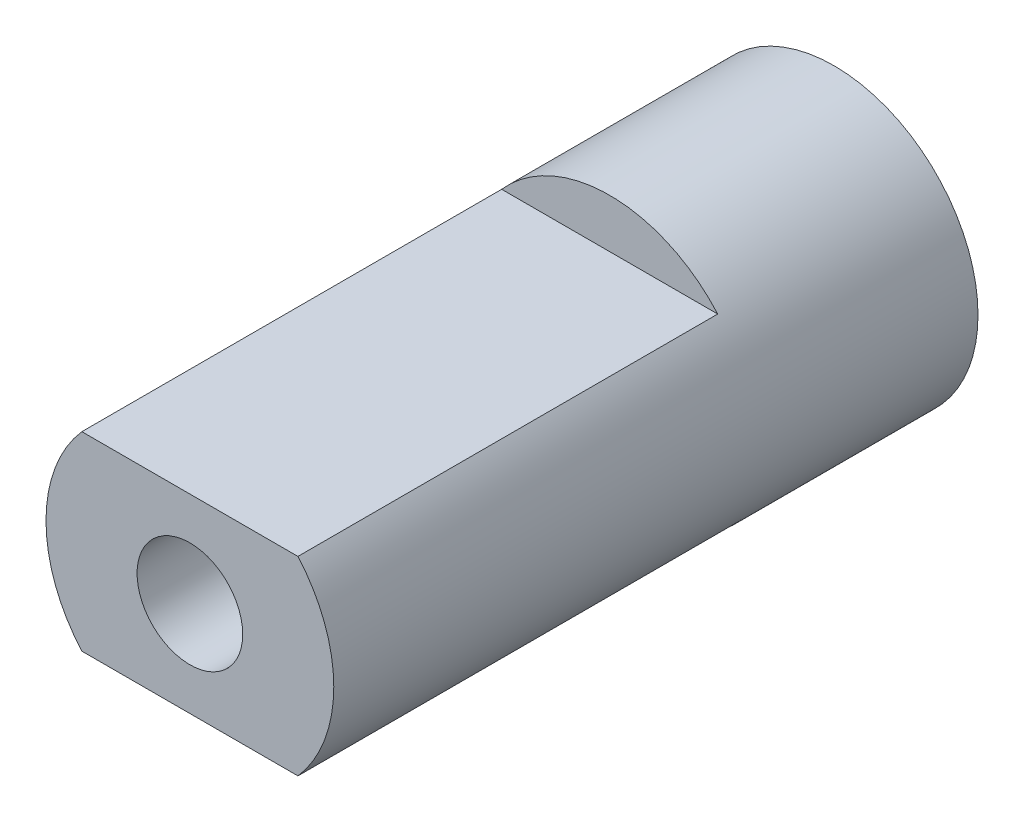
ISO-10303-21;
HEADER;
FILE_DESCRIPTION(('STEP AP214'),'2;1');
FILE_NAME('part.step','',(''),(''),'','','');
FILE_SCHEMA(('AUTOMOTIVE_DESIGN { 1 0 10303 214 1 1 1 1 }'));
ENDSEC;
DATA;
#1=APPLICATION_CONTEXT('core data for automotive mechanical design processes');
#2=APPLICATION_PROTOCOL_DEFINITION('international standard','automotive_design',2000,#1);
#3=PRODUCT_CONTEXT('',#1,'mechanical');
#4=PRODUCT('Part','Part','',(#3));
#5=PRODUCT_RELATED_PRODUCT_CATEGORY('part','',(#4));
#6=PRODUCT_DEFINITION_FORMATION('','',#4);
#7=PRODUCT_DEFINITION_CONTEXT('part definition',#1,'design');
#8=PRODUCT_DEFINITION('design','',#6,#7);
#9=PRODUCT_DEFINITION_SHAPE('','',#8);
#10=(LENGTH_UNIT() NAMED_UNIT(*) SI_UNIT(.MILLI.,.METRE.));
#11=(NAMED_UNIT(*) PLANE_ANGLE_UNIT() SI_UNIT($,.RADIAN.));
#12=(NAMED_UNIT(*) SI_UNIT($,.STERADIAN.) SOLID_ANGLE_UNIT());
#13=UNCERTAINTY_MEASURE_WITH_UNIT(LENGTH_MEASURE(1.E-05),#10,'distance_accuracy_value','');
#14=(GEOMETRIC_REPRESENTATION_CONTEXT(3) GLOBAL_UNCERTAINTY_ASSIGNED_CONTEXT((#13)) GLOBAL_UNIT_ASSIGNED_CONTEXT((#10,
#11,#12)) REPRESENTATION_CONTEXT('',''));
#15=CARTESIAN_POINT('',(0.,0.,0.));
#16=DIRECTION('',(0.,0.,1.));
#17=DIRECTION('',(1.,0.,0.));
#18=AXIS2_PLACEMENT_3D('',#15,#16,#17);
#19=CARTESIAN_POINT('',(0.,0.,3.));
#20=DIRECTION('',(0.,0.,-1.));
#21=DIRECTION('',(-1.,0.,0.));
#22=AXIS2_PLACEMENT_3D('',#19,#20,#21);
#23=CYLINDRICAL_SURFACE('',#22,1.);
#24=CARTESIAN_POINT('',(0.,0.,13.3));
#25=DIRECTION('',(0.,0.,1.));
#26=DIRECTION('',(1.,0.,0.));
#27=AXIS2_PLACEMENT_3D('',#24,#25,#26);
#28=CIRCLE('',#27,1.);
#29=CARTESIAN_POINT('',(1.,0.,13.3));
#30=VERTEX_POINT('',#29);
#31=EDGE_CURVE('E105',#30,#30,#28,.T.);
#32=ORIENTED_EDGE('',*,*,#31,.T.);
#33=EDGE_LOOP('',(#32));
#34=FACE_BOUND('',#33,.T.);
#35=CARTESIAN_POINT('',(0.,0.,1.1));
#36=DIRECTION('',(0.,0.,1.));
#37=DIRECTION('',(1.,0.,0.));
#38=AXIS2_PLACEMENT_3D('',#35,#36,#37);
#39=CIRCLE('',#38,1.);
#40=CARTESIAN_POINT('',(1.,0.,1.1));
#41=VERTEX_POINT('',#40);
#42=EDGE_CURVE('E139',#41,#41,#39,.T.);
#43=ORIENTED_EDGE('',*,*,#42,.F.);
#44=EDGE_LOOP('',(#43));
#45=FACE_BOUND('',#44,.T.);
#46=ADVANCED_FACE('F32',(#34,#45),#23,.F.);
#47=CARTESIAN_POINT('',(0.,0.,13.3));
#48=DIRECTION('',(0.,0.,1.));
#49=DIRECTION('',(1.,0.,0.));
#50=AXIS2_PLACEMENT_3D('',#47,#48,#49);
#51=PLANE('',#50);
#52=DIRECTION('',(1.,0.,0.));
#53=VECTOR('',#52,1.);
#54=CARTESIAN_POINT('',(-2.04588000625648,1.8,13.3));
#55=LINE('',#54,#53);
#56=CARTESIAN_POINT('',(-2.04588000625648,1.8,13.3));
#57=VERTEX_POINT('',#56);
#58=CARTESIAN_POINT('',(2.04588000625648,1.8,13.3));
#59=VERTEX_POINT('',#58);
#60=EDGE_CURVE('E92',#57,#59,#55,.T.);
#61=ORIENTED_EDGE('',*,*,#60,.F.);
#62=CARTESIAN_POINT('',(0.,0.,13.3));
#63=DIRECTION('',(0.,0.,1.));
#64=DIRECTION('',(1.,0.,0.));
#65=AXIS2_PLACEMENT_3D('',#62,#63,#64);
#66=CIRCLE('',#65,2.725);
#67=CARTESIAN_POINT('',(-2.04588000625648,-1.8,13.3));
#68=VERTEX_POINT('',#67);
#69=EDGE_CURVE('E39',#57,#68,#66,.T.);
#70=ORIENTED_EDGE('',*,*,#69,.T.);
#71=DIRECTION('',(-1.,0.,0.));
#72=VECTOR('',#71,1.);
#73=CARTESIAN_POINT('',(-2.04588000625648,-1.8,13.3));
#74=LINE('',#73,#72);
#75=CARTESIAN_POINT('',(2.04588000625648,-1.8,13.3));
#76=VERTEX_POINT('',#75);
#77=EDGE_CURVE('E83',#76,#68,#74,.T.);
#78=ORIENTED_EDGE('',*,*,#77,.F.);
#79=EDGE_CURVE('E11',#76,#59,#66,.T.);
#80=ORIENTED_EDGE('',*,*,#79,.T.);
#81=EDGE_LOOP('',(#61,#70,#78,#80));
#82=FACE_BOUND('',#81,.T.);
#83=ORIENTED_EDGE('',*,*,#31,.F.);
#84=EDGE_LOOP('',(#83));
#85=FACE_BOUND('',#84,.T.);
#86=ADVANCED_FACE('F111',(#82,#85),#51,.T.);
#87=CARTESIAN_POINT('',(0.,0.,13.3));
#88=DIRECTION('',(0.,0.,-1.));
#89=DIRECTION('',(-1.,0.,0.));
#90=AXIS2_PLACEMENT_3D('',#87,#88,#89);
#91=CYLINDRICAL_SURFACE('',#90,2.725);
#92=CARTESIAN_POINT('',(0.,0.,1.1));
#93=DIRECTION('',(0.,0.,1.));
#94=DIRECTION('',(1.,0.,0.));
#95=AXIS2_PLACEMENT_3D('',#92,#93,#94);
#96=CIRCLE('',#95,2.725);
#97=CARTESIAN_POINT('',(2.725,0.,1.1));
#98=VERTEX_POINT('',#97);
#99=EDGE_CURVE('E89',#98,#98,#96,.T.);
#100=ORIENTED_EDGE('',*,*,#99,.T.);
#101=EDGE_LOOP('',(#100));
#102=FACE_BOUND('',#101,.T.);
#103=CARTESIAN_POINT('',(0.,0.,5.35));
#104=DIRECTION('',(0.,0.,1.));
#105=DIRECTION('',(1.,0.,0.));
#106=AXIS2_PLACEMENT_3D('',#103,#104,#105);
#107=CIRCLE('',#106,2.725);
#108=CARTESIAN_POINT('',(2.04588000625648,1.8,5.35));
#109=VERTEX_POINT('',#108);
#110=CARTESIAN_POINT('',(-2.04588000625648,1.8,5.35));
#111=VERTEX_POINT('',#110);
#112=EDGE_CURVE('E94',#109,#111,#107,.T.);
#113=ORIENTED_EDGE('',*,*,#112,.F.);
#114=DIRECTION('',(0.,0.,1.));
#115=VECTOR('',#114,1.);
#116=CARTESIAN_POINT('',(2.04588000625648,1.8,5.35));
#117=LINE('',#116,#115);
#118=EDGE_CURVE('E101',#109,#59,#117,.T.);
#119=ORIENTED_EDGE('',*,*,#118,.T.);
#120=ORIENTED_EDGE('',*,*,#79,.F.);
#121=DIRECTION('',(0.,0.,1.));
#122=VECTOR('',#121,1.);
#123=CARTESIAN_POINT('',(2.04588000625648,-1.8,5.35));
#124=LINE('',#123,#122);
#125=CARTESIAN_POINT('',(2.04588000625648,-1.8,4.9));
#126=VERTEX_POINT('',#125);
#127=EDGE_CURVE('E73',#126,#76,#124,.T.);
#128=ORIENTED_EDGE('',*,*,#127,.F.);
#129=CARTESIAN_POINT('',(0.,0.,4.9));
#130=DIRECTION('',(0.,0.,1.));
#131=DIRECTION('',(1.,0.,0.));
#132=AXIS2_PLACEMENT_3D('',#129,#130,#131);
#133=CIRCLE('',#132,2.725);
#134=CARTESIAN_POINT('',(-2.04588000625648,-1.8,4.9));
#135=VERTEX_POINT('',#134);
#136=EDGE_CURVE('E78',#135,#126,#133,.T.);
#137=ORIENTED_EDGE('',*,*,#136,.F.);
#138=DIRECTION('',(0.,0.,1.));
#139=VECTOR('',#138,1.);
#140=CARTESIAN_POINT('',(-2.04588000625648,-1.8,5.35));
#141=LINE('',#140,#139);
#142=EDGE_CURVE('E82',#135,#68,#141,.T.);
#143=ORIENTED_EDGE('',*,*,#142,.T.);
#144=ORIENTED_EDGE('',*,*,#69,.F.);
#145=DIRECTION('',(0.,0.,1.));
#146=VECTOR('',#145,1.);
#147=CARTESIAN_POINT('',(-2.04588000625648,1.8,5.35));
#148=LINE('',#147,#146);
#149=EDGE_CURVE('E99',#111,#57,#148,.T.);
#150=ORIENTED_EDGE('',*,*,#149,.F.);
#151=EDGE_LOOP('',(#113,#119,#120,#128,#137,#143,#144,#150));
#152=FACE_BOUND('',#151,.T.);
#153=ADVANCED_FACE('F76',(#102,#152),#91,.T.);
#154=CARTESIAN_POINT('',(-2.04588000625648,-1.8,5.35));
#155=DIRECTION('',(0.,1.,0.));
#156=DIRECTION('',(0.,0.,1.));
#157=AXIS2_PLACEMENT_3D('',#154,#155,#156);
#158=PLANE('',#157);
#159=ORIENTED_EDGE('',*,*,#77,.T.);
#160=ORIENTED_EDGE('',*,*,#142,.F.);
#161=DIRECTION('',(-1.,0.,0.));
#162=VECTOR('',#161,1.);
#163=CARTESIAN_POINT('',(2.04588000625648,-1.8,4.9));
#164=LINE('',#163,#162);
#165=EDGE_CURVE('E88',#126,#135,#164,.T.);
#166=ORIENTED_EDGE('',*,*,#165,.F.);
#167=ORIENTED_EDGE('',*,*,#127,.T.);
#168=EDGE_LOOP('',(#159,#160,#166,#167));
#169=FACE_BOUND('',#168,.T.);
#170=ADVANCED_FACE('F91',(#169),#158,.F.);
#171=CARTESIAN_POINT('',(-2.04588000625648,1.8,5.35));
#172=DIRECTION('',(0.,-1.,0.));
#173=DIRECTION('',(0.,0.,-1.));
#174=AXIS2_PLACEMENT_3D('',#171,#172,#173);
#175=PLANE('',#174);
#176=ORIENTED_EDGE('',*,*,#60,.T.);
#177=ORIENTED_EDGE('',*,*,#118,.F.);
#178=DIRECTION('',(1.,0.,0.));
#179=VECTOR('',#178,1.);
#180=CARTESIAN_POINT('',(-2.04588000625648,1.8,5.35));
#181=LINE('',#180,#179);
#182=EDGE_CURVE('E45',#111,#109,#181,.T.);
#183=ORIENTED_EDGE('',*,*,#182,.F.);
#184=ORIENTED_EDGE('',*,*,#149,.T.);
#185=EDGE_LOOP('',(#176,#177,#183,#184));
#186=FACE_BOUND('',#185,.T.);
#187=ADVANCED_FACE('F122',(#186),#175,.F.);
#188=CARTESIAN_POINT('',(0.,0.,5.35));
#189=DIRECTION('',(0.,0.,1.));
#190=DIRECTION('',(1.,0.,0.));
#191=AXIS2_PLACEMENT_3D('',#188,#189,#190);
#192=PLANE('',#191);
#193=ORIENTED_EDGE('',*,*,#112,.T.);
#194=ORIENTED_EDGE('',*,*,#182,.T.);
#195=EDGE_LOOP('',(#193,#194));
#196=FACE_BOUND('',#195,.T.);
#197=ADVANCED_FACE('F125',(#196),#192,.T.);
#198=CARTESIAN_POINT('',(0.,0.,4.9));
#199=DIRECTION('',(0.,0.,1.));
#200=DIRECTION('',(1.,0.,0.));
#201=AXIS2_PLACEMENT_3D('',#198,#199,#200);
#202=PLANE('',#201);
#203=ORIENTED_EDGE('',*,*,#136,.T.);
#204=ORIENTED_EDGE('',*,*,#165,.T.);
#205=EDGE_LOOP('',(#203,#204));
#206=FACE_BOUND('',#205,.T.);
#207=ADVANCED_FACE('F87',(#206),#202,.T.);
#208=CARTESIAN_POINT('',(0.,0.,1.1));
#209=DIRECTION('',(0.,0.,1.));
#210=DIRECTION('',(1.,0.,0.));
#211=AXIS2_PLACEMENT_3D('',#208,#209,#210);
#212=PLANE('',#211);
#213=ORIENTED_EDGE('',*,*,#42,.T.);
#214=EDGE_LOOP('',(#213));
#215=FACE_BOUND('',#214,.T.);
#216=ORIENTED_EDGE('',*,*,#99,.F.);
#217=EDGE_LOOP('',(#216));
#218=FACE_BOUND('',#217,.T.);
#219=ADVANCED_FACE('F131',(#215,#218),#212,.F.);
#220=CLOSED_SHELL('',(#46,#86,#153,#170,#187,#197,#207,#219));
#221=MANIFOLD_SOLID_BREP('B2',#220);
#222=ADVANCED_BREP_SHAPE_REPRESENTATION('',(#18,#221),#14);
#223=SHAPE_DEFINITION_REPRESENTATION(#9,#222);
ENDSEC;
END-ISO-10303-21;
